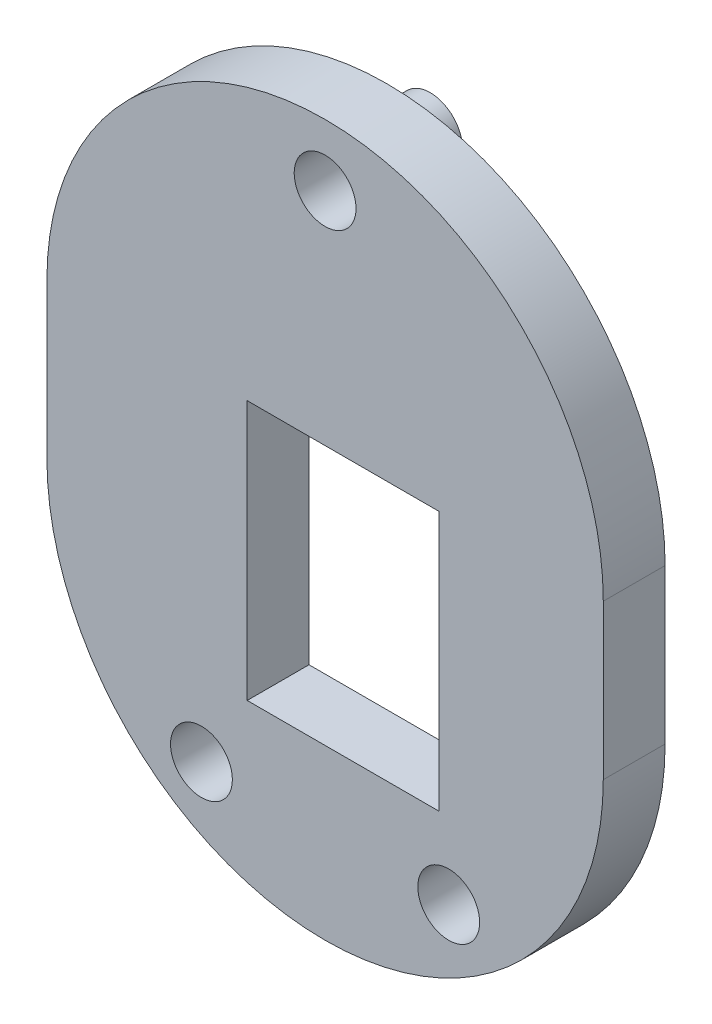
ISO-10303-21;
HEADER;
FILE_DESCRIPTION(('STEP AP214'),'2;1');
FILE_NAME('part.step','',(''),(''),'','','');
FILE_SCHEMA(('AUTOMOTIVE_DESIGN { 1 0 10303 214 1 1 1 1 }'));
ENDSEC;
DATA;
#1=APPLICATION_CONTEXT('core data for automotive mechanical design processes');
#2=APPLICATION_PROTOCOL_DEFINITION('international standard','automotive_design',2000,#1);
#3=PRODUCT_CONTEXT('',#1,'mechanical');
#4=PRODUCT('Part','Part','',(#3));
#5=PRODUCT_RELATED_PRODUCT_CATEGORY('part','',(#4));
#6=PRODUCT_DEFINITION_FORMATION('','',#4);
#7=PRODUCT_DEFINITION_CONTEXT('part definition',#1,'design');
#8=PRODUCT_DEFINITION('design','',#6,#7);
#9=PRODUCT_DEFINITION_SHAPE('','',#8);
#10=(LENGTH_UNIT() NAMED_UNIT(*) SI_UNIT(.MILLI.,.METRE.));
#11=(NAMED_UNIT(*) PLANE_ANGLE_UNIT() SI_UNIT($,.RADIAN.));
#12=(NAMED_UNIT(*) SI_UNIT($,.STERADIAN.) SOLID_ANGLE_UNIT());
#13=UNCERTAINTY_MEASURE_WITH_UNIT(LENGTH_MEASURE(1.E-05),#10,'distance_accuracy_value','');
#14=(GEOMETRIC_REPRESENTATION_CONTEXT(3) GLOBAL_UNCERTAINTY_ASSIGNED_CONTEXT((#13)) GLOBAL_UNIT_ASSIGNED_CONTEXT((#10,
#11,#12)) REPRESENTATION_CONTEXT('',''));
#15=CARTESIAN_POINT('',(0.,0.,0.));
#16=DIRECTION('',(0.,0.,1.));
#17=DIRECTION('',(1.,0.,0.));
#18=AXIS2_PLACEMENT_3D('',#15,#16,#17);
#19=CARTESIAN_POINT('',(0.,12.5,-1.7));
#20=DIRECTION('',(0.,0.,-1.));
#21=DIRECTION('',(1.,0.,0.));
#22=AXIS2_PLACEMENT_3D('',#19,#20,#21);
#23=PLANE('',#22);
#24=DIRECTION('',(0.,1.,0.));
#25=VECTOR('',#24,1.);
#26=CARTESIAN_POINT('',(-37.,-6.48399884812534,-1.7));
#27=LINE('',#26,#25);
#28=CARTESIAN_POINT('',(-37.,-2.55,-1.7));
#29=VERTEX_POINT('',#28);
#30=CARTESIAN_POINT('',(-37.,0.7,-1.7));
#31=VERTEX_POINT('',#30);
#32=EDGE_CURVE('E237',#29,#31,#27,.T.);
#33=ORIENTED_EDGE('',*,*,#32,.F.);
#34=DIRECTION('',(-1.,0.,0.));
#35=VECTOR('',#34,1.);
#36=CARTESIAN_POINT('',(-14.5,-2.55,-1.7));
#37=LINE('',#36,#35);
#38=CARTESIAN_POINT('',(-39.5,-2.55,-1.7));
#39=VERTEX_POINT('',#38);
#40=EDGE_CURVE('E224',#29,#39,#37,.T.);
#41=ORIENTED_EDGE('',*,*,#40,.T.);
#42=DIRECTION('',(0.,1.,0.));
#43=VECTOR('',#42,1.);
#44=CARTESIAN_POINT('',(-39.5,-4.87523873730206,-1.7));
#45=LINE('',#44,#43);
#46=CARTESIAN_POINT('',(-39.5,0.7,-1.7));
#47=VERTEX_POINT('',#46);
#48=EDGE_CURVE('E235',#39,#47,#45,.T.);
#49=ORIENTED_EDGE('',*,*,#48,.T.);
#50=DIRECTION('',(1.,0.,0.));
#51=VECTOR('',#50,1.);
#52=CARTESIAN_POINT('',(-36.6510171443224,0.7,-1.7));
#53=LINE('',#52,#51);
#54=EDGE_CURVE('E254',#47,#31,#53,.T.);
#55=ORIENTED_EDGE('',*,*,#54,.T.);
#56=EDGE_LOOP('',(#33,#41,#49,#55));
#57=FACE_BOUND('',#56,.T.);
#58=ADVANCED_FACE('F16',(#57),#23,.T.);
#59=CARTESIAN_POINT('',(-39.5,-4.87523873730206,-1.7));
#60=DIRECTION('',(1.,0.,0.));
#61=DIRECTION('',(0.,1.,0.));
#62=AXIS2_PLACEMENT_3D('',#59,#60,#61);
#63=PLANE('',#62);
#64=DIRECTION('',(0.,0.,1.));
#65=VECTOR('',#64,1.);
#66=CARTESIAN_POINT('',(-39.5,-10.55,-0.85));
#67=LINE('',#66,#65);
#68=CARTESIAN_POINT('',(-39.5,-10.55,-1.7));
#69=VERTEX_POINT('',#68);
#70=CARTESIAN_POINT('',(-39.5,-10.55,-1.));
#71=VERTEX_POINT('',#70);
#72=EDGE_CURVE('E230',#69,#71,#67,.T.);
#73=ORIENTED_EDGE('',*,*,#72,.F.);
#74=CARTESIAN_POINT('',(-39.5,-13.8,-1.7));
#75=VERTEX_POINT('',#74);
#76=EDGE_CURVE('E247',#75,#69,#45,.T.);
#77=ORIENTED_EDGE('',*,*,#76,.F.);
#78=DIRECTION('',(0.,0.,1.));
#79=VECTOR('',#78,1.);
#80=CARTESIAN_POINT('',(-39.5,-13.8,-1.7));
#81=LINE('',#80,#79);
#82=CARTESIAN_POINT('',(-39.5,-13.8,0.));
#83=VERTEX_POINT('',#82);
#84=EDGE_CURVE('E269',#75,#83,#81,.T.);
#85=ORIENTED_EDGE('',*,*,#84,.T.);
#86=DIRECTION('',(0.,1.,0.));
#87=VECTOR('',#86,1.);
#88=CARTESIAN_POINT('',(-39.5,-4.87523873730206,0.));
#89=LINE('',#88,#87);
#90=CARTESIAN_POINT('',(-39.5,-13.,0.));
#91=VERTEX_POINT('',#90);
#92=EDGE_CURVE('E270',#83,#91,#89,.T.);
#93=ORIENTED_EDGE('',*,*,#92,.T.);
#94=DIRECTION('',(0.,0.,-1.));
#95=VECTOR('',#94,1.);
#96=CARTESIAN_POINT('',(-39.5,-13.,-0.5));
#97=LINE('',#96,#95);
#98=CARTESIAN_POINT('',(-39.5,-13.,-1.));
#99=VERTEX_POINT('',#98);
#100=EDGE_CURVE('E543',#91,#99,#97,.T.);
#101=ORIENTED_EDGE('',*,*,#100,.T.);
#102=DIRECTION('',(0.,1.,0.));
#103=VECTOR('',#102,1.);
#104=CARTESIAN_POINT('',(-39.5,-7.32912922858444,-1.));
#105=LINE('',#104,#103);
#106=EDGE_CURVE('E547',#99,#71,#105,.T.);
#107=ORIENTED_EDGE('',*,*,#106,.T.);
#108=EDGE_LOOP('',(#73,#77,#85,#93,#101,#107));
#109=FACE_BOUND('',#108,.T.);
#110=ADVANCED_FACE('F613',(#109),#63,.F.);
#111=CARTESIAN_POINT('',(-37.,-6.48399884812534,-1.7));
#112=DIRECTION('',(1.,0.,0.));
#113=DIRECTION('',(0.,1.,0.));
#114=AXIS2_PLACEMENT_3D('',#111,#112,#113);
#115=PLANE('',#114);
#116=DIRECTION('',(0.,-1.,0.));
#117=VECTOR('',#116,1.);
#118=CARTESIAN_POINT('',(-37.,-6.48399884812534,-1.));
#119=LINE('',#118,#117);
#120=CARTESIAN_POINT('',(-37.,0.,-1.));
#121=VERTEX_POINT('',#120);
#122=CARTESIAN_POINT('',(-37.,-2.55,-1.));
#123=VERTEX_POINT('',#122);
#124=EDGE_CURVE('E373',#121,#123,#119,.T.);
#125=ORIENTED_EDGE('',*,*,#124,.T.);
#126=DIRECTION('',(0.,0.,-1.));
#127=VECTOR('',#126,1.);
#128=CARTESIAN_POINT('',(-37.,-2.55,-1.7));
#129=LINE('',#128,#127);
#130=EDGE_CURVE('E495',#123,#29,#129,.T.);
#131=ORIENTED_EDGE('',*,*,#130,.T.);
#132=ORIENTED_EDGE('',*,*,#32,.T.);
#133=DIRECTION('',(0.,0.,1.));
#134=VECTOR('',#133,1.);
#135=CARTESIAN_POINT('',(-37.,0.7,-1.7));
#136=LINE('',#135,#134);
#137=CARTESIAN_POINT('',(-37.,0.7,0.));
#138=VERTEX_POINT('',#137);
#139=EDGE_CURVE('E286',#31,#138,#136,.T.);
#140=ORIENTED_EDGE('',*,*,#139,.T.);
#141=DIRECTION('',(0.,1.,0.));
#142=VECTOR('',#141,1.);
#143=CARTESIAN_POINT('',(-37.,-6.48399884812534,0.));
#144=LINE('',#143,#142);
#145=CARTESIAN_POINT('',(-37.,0.,0.));
#146=VERTEX_POINT('',#145);
#147=EDGE_CURVE('E278',#146,#138,#144,.T.);
#148=ORIENTED_EDGE('',*,*,#147,.F.);
#149=DIRECTION('',(0.,0.,1.));
#150=VECTOR('',#149,1.);
#151=CARTESIAN_POINT('',(-37.,0.,-1.7));
#152=LINE('',#151,#150);
#153=EDGE_CURVE('E492',#121,#146,#152,.T.);
#154=ORIENTED_EDGE('',*,*,#153,.F.);
#155=EDGE_LOOP('',(#125,#131,#132,#140,#148,#154));
#156=FACE_BOUND('',#155,.T.);
#157=ADVANCED_FACE('F563',(#156),#115,.T.);
#158=CARTESIAN_POINT('',(0.,12.5,0.));
#159=DIRECTION('',(0.,0.,1.));
#160=DIRECTION('',(1.,0.,0.));
#161=AXIS2_PLACEMENT_3D('',#158,#159,#160);
#162=PLANE('',#161);
#163=CARTESIAN_POINT('',(-39.5,0.,0.));
#164=VERTEX_POINT('',#163);
#165=CARTESIAN_POINT('',(-39.5,0.7,0.));
#166=VERTEX_POINT('',#165);
#167=EDGE_CURVE('E239',#164,#166,#89,.T.);
#168=ORIENTED_EDGE('',*,*,#167,.F.);
#169=DIRECTION('',(-1.,0.,0.));
#170=VECTOR('',#169,1.);
#171=CARTESIAN_POINT('',(-14.5,0.,0.));
#172=LINE('',#171,#170);
#173=EDGE_CURVE('E529',#146,#164,#172,.T.);
#174=ORIENTED_EDGE('',*,*,#173,.F.);
#175=ORIENTED_EDGE('',*,*,#147,.T.);
#176=DIRECTION('',(1.,0.,0.));
#177=VECTOR('',#176,1.);
#178=CARTESIAN_POINT('',(-36.6510171443224,0.7,0.));
#179=LINE('',#178,#177);
#180=EDGE_CURVE('E274',#166,#138,#179,.T.);
#181=ORIENTED_EDGE('',*,*,#180,.F.);
#182=EDGE_LOOP('',(#168,#174,#175,#181));
#183=FACE_BOUND('',#182,.T.);
#184=CARTESIAN_POINT('',(-37.,-13.8,0.));
#185=VERTEX_POINT('',#184);
#186=CARTESIAN_POINT('',(-37.,-13.,0.));
#187=VERTEX_POINT('',#186);
#188=EDGE_CURVE('E49',#185,#187,#144,.T.);
#189=ORIENTED_EDGE('',*,*,#188,.T.);
#190=DIRECTION('',(-1.,0.,0.));
#191=VECTOR('',#190,1.);
#192=CARTESIAN_POINT('',(-14.5,-13.,0.));
#193=LINE('',#192,#191);
#194=EDGE_CURVE('E524',#187,#91,#193,.T.);
#195=ORIENTED_EDGE('',*,*,#194,.T.);
#196=ORIENTED_EDGE('',*,*,#92,.F.);
#197=DIRECTION('',(1.,0.,0.));
#198=VECTOR('',#197,1.);
#199=CARTESIAN_POINT('',(-36.6510171443224,-13.8,0.));
#200=LINE('',#199,#198);
#201=EDGE_CURVE('E248',#83,#185,#200,.T.);
#202=ORIENTED_EDGE('',*,*,#201,.T.);
#203=EDGE_LOOP('',(#189,#195,#196,#202));
#204=FACE_BOUND('',#203,.T.);
#205=DIRECTION('',(1.,0.,0.));
#206=VECTOR('',#205,1.);
#207=CARTESIAN_POINT('',(2.93168006464839,26.8,0.));
#208=LINE('',#207,#206);
#209=CARTESIAN_POINT('',(-12.6,26.8,0.));
#210=VERTEX_POINT('',#209);
#211=CARTESIAN_POINT('',(18.4,26.8,0.));
#212=VERTEX_POINT('',#211);
#213=EDGE_CURVE('E292',#210,#212,#208,.T.);
#214=ORIENTED_EDGE('',*,*,#213,.F.);
#215=DIRECTION('',(0.,-1.,0.));
#216=VECTOR('',#215,1.);
#217=CARTESIAN_POINT('',(-12.6,-19.7,0.));
#218=LINE('',#217,#216);
#219=CARTESIAN_POINT('',(-12.6,24.3,0.));
#220=VERTEX_POINT('',#219);
#221=EDGE_CURVE('E298',#210,#220,#218,.T.);
#222=ORIENTED_EDGE('',*,*,#221,.T.);
#223=DIRECTION('',(0.,-1.,0.));
#224=VECTOR('',#223,1.);
#225=CARTESIAN_POINT('',(-12.6,12.5,0.));
#226=LINE('',#225,#224);
#227=CARTESIAN_POINT('',(-12.6,-17.7,0.));
#228=VERTEX_POINT('',#227);
#229=EDGE_CURVE('E390',#220,#228,#226,.T.);
#230=ORIENTED_EDGE('',*,*,#229,.T.);
#231=DIRECTION('',(1.,0.,0.));
#232=VECTOR('',#231,1.);
#233=CARTESIAN_POINT('',(0.,-17.7,0.));
#234=LINE('',#233,#232);
#235=CARTESIAN_POINT('',(18.4,-17.7,0.));
#236=VERTEX_POINT('',#235);
#237=EDGE_CURVE('E464',#228,#236,#234,.T.);
#238=ORIENTED_EDGE('',*,*,#237,.T.);
#239=DIRECTION('',(0.,-1.,0.));
#240=VECTOR('',#239,1.);
#241=CARTESIAN_POINT('',(18.4,12.5,0.));
#242=LINE('',#241,#240);
#243=CARTESIAN_POINT('',(18.4,24.3,0.));
#244=VERTEX_POINT('',#243);
#245=EDGE_CURVE('E461',#244,#236,#242,.T.);
#246=ORIENTED_EDGE('',*,*,#245,.F.);
#247=DIRECTION('',(0.,-1.,0.));
#248=VECTOR('',#247,1.);
#249=CARTESIAN_POINT('',(18.4,-19.6493687108159,0.));
#250=LINE('',#249,#248);
#251=EDGE_CURVE('E313',#212,#244,#250,.T.);
#252=ORIENTED_EDGE('',*,*,#251,.F.);
#253=EDGE_LOOP('',(#214,#222,#230,#238,#246,#252));
#254=FACE_BOUND('',#253,.T.);
#255=CARTESIAN_POINT('',(-20.,-30.,0.));
#256=DIRECTION('',(0.,0.,-1.));
#257=DIRECTION('',(1.,0.,0.));
#258=AXIS2_PLACEMENT_3D('',#255,#256,#257);
#259=CIRCLE('',#258,5.25);
#260=CARTESIAN_POINT('',(-14.75,-30.,0.));
#261=VERTEX_POINT('',#260);
#262=EDGE_CURVE('E369',#261,#261,#259,.T.);
#263=ORIENTED_EDGE('',*,*,#262,.F.);
#264=EDGE_LOOP('',(#263));
#265=FACE_BOUND('',#264,.T.);
#266=CARTESIAN_POINT('',(20.,-30.,0.));
#267=DIRECTION('',(0.,0.,-1.));
#268=DIRECTION('',(1.,0.,0.));
#269=AXIS2_PLACEMENT_3D('',#266,#267,#268);
#270=CIRCLE('',#269,5.25);
#271=CARTESIAN_POINT('',(25.25,-30.,0.));
#272=VERTEX_POINT('',#271);
#273=EDGE_CURVE('E374',#272,#272,#270,.T.);
#274=ORIENTED_EDGE('',*,*,#273,.F.);
#275=EDGE_LOOP('',(#274));
#276=FACE_BOUND('',#275,.T.);
#277=CARTESIAN_POINT('',(0.,60.,0.));
#278=DIRECTION('',(0.,0.,-1.));
#279=DIRECTION('',(1.,0.,0.));
#280=AXIS2_PLACEMENT_3D('',#277,#278,#279);
#281=CIRCLE('',#280,5.25);
#282=CARTESIAN_POINT('',(5.25,60.,0.));
#283=VERTEX_POINT('',#282);
#284=EDGE_CURVE('E382',#283,#283,#281,.T.);
#285=ORIENTED_EDGE('',*,*,#284,.F.);
#286=EDGE_LOOP('',(#285));
#287=FACE_BOUND('',#286,.T.);
#288=CARTESIAN_POINT('',(0.,25.,0.));
#289=DIRECTION('',(0.,0.,1.));
#290=DIRECTION('',(1.,0.,0.));
#291=AXIS2_PLACEMENT_3D('',#288,#289,#290);
#292=CIRCLE('',#291,45.);
#293=CARTESIAN_POINT('',(-45.,25.,0.));
#294=VERTEX_POINT('',#293);
#295=CARTESIAN_POINT('',(45.,25.,0.));
#296=VERTEX_POINT('',#295);
#297=EDGE_CURVE('E448',#294,#296,#292,.F.);
#298=ORIENTED_EDGE('',*,*,#297,.T.);
#299=DIRECTION('',(0.,-1.,0.));
#300=VECTOR('',#299,1.);
#301=CARTESIAN_POINT('',(45.,35.2162681519985,0.));
#302=LINE('',#301,#300);
#303=CARTESIAN_POINT('',(45.,0.,0.));
#304=VERTEX_POINT('',#303);
#305=EDGE_CURVE('E419',#296,#304,#302,.T.);
#306=ORIENTED_EDGE('',*,*,#305,.T.);
#307=CARTESIAN_POINT('',(0.,0.,0.));
#308=DIRECTION('',(0.,0.,1.));
#309=DIRECTION('',(-1.,0.,0.));
#310=AXIS2_PLACEMENT_3D('',#307,#308,#309);
#311=CIRCLE('',#310,45.);
#312=CARTESIAN_POINT('',(-45.,0.,0.));
#313=VERTEX_POINT('',#312);
#314=EDGE_CURVE('E424',#313,#304,#311,.T.);
#315=ORIENTED_EDGE('',*,*,#314,.F.);
#316=DIRECTION('',(0.,1.,0.));
#317=VECTOR('',#316,1.);
#318=CARTESIAN_POINT('',(-45.,35.2162681519985,0.));
#319=LINE('',#318,#317);
#320=EDGE_CURVE('E435',#313,#294,#319,.T.);
#321=ORIENTED_EDGE('',*,*,#320,.T.);
#322=EDGE_LOOP('',(#298,#306,#315,#321));
#323=FACE_BOUND('',#322,.T.);
#324=ADVANCED_FACE('F558',(#183,#204,#254,#265,#276,#287,#323),#162,.F.);
#325=CARTESIAN_POINT('',(45.,35.2162681519985,10.));
#326=DIRECTION('',(1.,0.,0.));
#327=DIRECTION('',(0.,1.,0.));
#328=AXIS2_PLACEMENT_3D('',#325,#326,#327);
#329=PLANE('',#328);
#330=ORIENTED_EDGE('',*,*,#305,.F.);
#331=DIRECTION('',(0.,0.,-1.));
#332=VECTOR('',#331,1.);
#333=CARTESIAN_POINT('',(45.,25.,10.));
#334=LINE('',#333,#332);
#335=CARTESIAN_POINT('',(45.,25.,10.));
#336=VERTEX_POINT('',#335);
#337=EDGE_CURVE('E451',#296,#336,#334,.F.);
#338=ORIENTED_EDGE('',*,*,#337,.T.);
#339=DIRECTION('',(0.,-1.,0.));
#340=VECTOR('',#339,1.);
#341=CARTESIAN_POINT('',(45.,35.2162681519985,10.));
#342=LINE('',#341,#340);
#343=CARTESIAN_POINT('',(45.,0.,10.));
#344=VERTEX_POINT('',#343);
#345=EDGE_CURVE('E420',#336,#344,#342,.T.);
#346=ORIENTED_EDGE('',*,*,#345,.T.);
#347=DIRECTION('',(0.,0.,-1.));
#348=VECTOR('',#347,1.);
#349=CARTESIAN_POINT('',(45.,0.,10.));
#350=LINE('',#349,#348);
#351=EDGE_CURVE('E432',#344,#304,#350,.T.);
#352=ORIENTED_EDGE('',*,*,#351,.T.);
#353=EDGE_LOOP('',(#330,#338,#346,#352));
#354=FACE_BOUND('',#353,.T.);
#355=ADVANCED_FACE('F562',(#354),#329,.T.);
#356=CARTESIAN_POINT('',(-45.,35.2162681519985,10.));
#357=DIRECTION('',(-1.,0.,0.));
#358=DIRECTION('',(0.,0.,1.));
#359=AXIS2_PLACEMENT_3D('',#356,#357,#358);
#360=PLANE('',#359);
#361=DIRECTION('',(0.,1.,0.));
#362=VECTOR('',#361,1.);
#363=CARTESIAN_POINT('',(-45.,35.2162681519985,10.));
#364=LINE('',#363,#362);
#365=CARTESIAN_POINT('',(-45.,0.,10.));
#366=VERTEX_POINT('',#365);
#367=CARTESIAN_POINT('',(-45.,25.,10.));
#368=VERTEX_POINT('',#367);
#369=EDGE_CURVE('E423',#366,#368,#364,.T.);
#370=ORIENTED_EDGE('',*,*,#369,.T.);
#371=DIRECTION('',(0.,0.,-1.));
#372=VECTOR('',#371,1.);
#373=CARTESIAN_POINT('',(-45.,25.,10.));
#374=LINE('',#373,#372);
#375=EDGE_CURVE('E458',#368,#294,#374,.T.);
#376=ORIENTED_EDGE('',*,*,#375,.T.);
#377=ORIENTED_EDGE('',*,*,#320,.F.);
#378=DIRECTION('',(0.,0.,-1.));
#379=VECTOR('',#378,1.);
#380=CARTESIAN_POINT('',(-45.,0.,10.));
#381=LINE('',#380,#379);
#382=EDGE_CURVE('E445',#366,#313,#381,.T.);
#383=ORIENTED_EDGE('',*,*,#382,.F.);
#384=EDGE_LOOP('',(#370,#376,#377,#383));
#385=FACE_BOUND('',#384,.T.);
#386=ADVANCED_FACE('F656',(#385),#360,.T.);
#387=CARTESIAN_POINT('',(0.,0.,10.));
#388=DIRECTION('',(0.,0.,-1.));
#389=DIRECTION('',(-1.,0.,0.));
#390=AXIS2_PLACEMENT_3D('',#387,#388,#389);
#391=CYLINDRICAL_SURFACE('',#390,45.);
#392=ORIENTED_EDGE('',*,*,#314,.T.);
#393=ORIENTED_EDGE('',*,*,#351,.F.);
#394=CARTESIAN_POINT('',(0.,0.,10.));
#395=DIRECTION('',(0.,0.,1.));
#396=DIRECTION('',(-1.,0.,0.));
#397=AXIS2_PLACEMENT_3D('',#394,#395,#396);
#398=CIRCLE('',#397,45.);
#399=EDGE_CURVE('E428',#366,#344,#398,.T.);
#400=ORIENTED_EDGE('',*,*,#399,.F.);
#401=ORIENTED_EDGE('',*,*,#382,.T.);
#402=EDGE_LOOP('',(#392,#393,#400,#401));
#403=FACE_BOUND('',#402,.T.);
#404=ADVANCED_FACE('F659',(#403),#391,.T.);
#405=CARTESIAN_POINT('',(0.,12.5,10.));
#406=DIRECTION('',(0.,0.,1.));
#407=DIRECTION('',(1.,0.,0.));
#408=AXIS2_PLACEMENT_3D('',#405,#406,#407);
#409=PLANE('',#408);
#410=CARTESIAN_POINT('',(0.,60.,10.));
#411=DIRECTION('',(0.,0.,1.));
#412=DIRECTION('',(1.,0.,0.));
#413=AXIS2_PLACEMENT_3D('',#410,#411,#412);
#414=CIRCLE('',#413,5.);
#415=CARTESIAN_POINT('',(5.,60.,10.));
#416=VERTEX_POINT('',#415);
#417=EDGE_CURVE('E353',#416,#416,#414,.F.);
#418=ORIENTED_EDGE('',*,*,#417,.T.);
#419=EDGE_LOOP('',(#418));
#420=FACE_BOUND('',#419,.T.);
#421=CARTESIAN_POINT('',(20.,-30.,10.));
#422=DIRECTION('',(0.,0.,1.));
#423=DIRECTION('',(1.,0.,0.));
#424=AXIS2_PLACEMENT_3D('',#421,#422,#423);
#425=CIRCLE('',#424,5.);
#426=CARTESIAN_POINT('',(25.,-30.,10.));
#427=VERTEX_POINT('',#426);
#428=EDGE_CURVE('E358',#427,#427,#425,.F.);
#429=ORIENTED_EDGE('',*,*,#428,.T.);
#430=EDGE_LOOP('',(#429));
#431=FACE_BOUND('',#430,.T.);
#432=CARTESIAN_POINT('',(-20.,-30.,10.));
#433=DIRECTION('',(0.,0.,1.));
#434=DIRECTION('',(1.,0.,0.));
#435=AXIS2_PLACEMENT_3D('',#432,#433,#434);
#436=CIRCLE('',#435,5.);
#437=CARTESIAN_POINT('',(-15.,-30.,10.));
#438=VERTEX_POINT('',#437);
#439=EDGE_CURVE('E363',#438,#438,#436,.F.);
#440=ORIENTED_EDGE('',*,*,#439,.T.);
#441=EDGE_LOOP('',(#440));
#442=FACE_BOUND('',#441,.T.);
#443=DIRECTION('',(0.,-1.,0.));
#444=VECTOR('',#443,1.);
#445=CARTESIAN_POINT('',(-12.6,2.71059665828943,10.));
#446=LINE('',#445,#444);
#447=CARTESIAN_POINT('',(-12.6,24.3,10.));
#448=VERTEX_POINT('',#447);
#449=CARTESIAN_POINT('',(-12.6,-17.7,10.));
#450=VERTEX_POINT('',#449);
#451=EDGE_CURVE('E386',#448,#450,#446,.T.);
#452=ORIENTED_EDGE('',*,*,#451,.F.);
#453=DIRECTION('',(1.,0.,0.));
#454=VECTOR('',#453,1.);
#455=CARTESIAN_POINT('',(4.27989056333899,24.3,10.));
#456=LINE('',#455,#454);
#457=CARTESIAN_POINT('',(18.4,24.3,10.));
#458=VERTEX_POINT('',#457);
#459=EDGE_CURVE('E402',#448,#458,#456,.T.);
#460=ORIENTED_EDGE('',*,*,#459,.T.);
#461=DIRECTION('',(0.,-1.,0.));
#462=VECTOR('',#461,1.);
#463=CARTESIAN_POINT('',(18.4,2.71059665828944,10.));
#464=LINE('',#463,#462);
#465=CARTESIAN_POINT('',(18.4,-17.7,10.));
#466=VERTEX_POINT('',#465);
#467=EDGE_CURVE('E398',#458,#466,#464,.T.);
#468=ORIENTED_EDGE('',*,*,#467,.T.);
#469=DIRECTION('',(1.,0.,0.));
#470=VECTOR('',#469,1.);
#471=CARTESIAN_POINT('',(2.9,-17.7,10.));
#472=LINE('',#471,#470);
#473=EDGE_CURVE('E394',#450,#466,#472,.T.);
#474=ORIENTED_EDGE('',*,*,#473,.F.);
#475=EDGE_LOOP('',(#452,#460,#468,#474));
#476=FACE_BOUND('',#475,.T.);
#477=ORIENTED_EDGE('',*,*,#345,.F.);
#478=CARTESIAN_POINT('',(0.,25.,10.));
#479=DIRECTION('',(0.,0.,1.));
#480=DIRECTION('',(1.,0.,0.));
#481=AXIS2_PLACEMENT_3D('',#478,#479,#480);
#482=CIRCLE('',#481,45.);
#483=EDGE_CURVE('E455',#336,#368,#482,.T.);
#484=ORIENTED_EDGE('',*,*,#483,.T.);
#485=ORIENTED_EDGE('',*,*,#369,.F.);
#486=ORIENTED_EDGE('',*,*,#399,.T.);
#487=EDGE_LOOP('',(#477,#484,#485,#486));
#488=FACE_BOUND('',#487,.T.);
#489=ADVANCED_FACE('F654',(#420,#431,#442,#476,#488),#409,.T.);
#490=CARTESIAN_POINT('',(0.,25.,10.));
#491=DIRECTION('',(0.,0.,-1.));
#492=DIRECTION('',(-1.,0.,0.));
#493=AXIS2_PLACEMENT_3D('',#490,#491,#492);
#494=CYLINDRICAL_SURFACE('',#493,45.);
#495=ORIENTED_EDGE('',*,*,#375,.F.);
#496=ORIENTED_EDGE('',*,*,#483,.F.);
#497=ORIENTED_EDGE('',*,*,#337,.F.);
#498=ORIENTED_EDGE('',*,*,#297,.F.);
#499=EDGE_LOOP('',(#495,#496,#497,#498));
#500=FACE_BOUND('',#499,.T.);
#501=ADVANCED_FACE('F18',(#500),#494,.T.);
#502=CARTESIAN_POINT('',(-12.6,2.71059665828943,-1.));
#503=DIRECTION('',(-1.,0.,0.));
#504=DIRECTION('',(0.,-1.,0.));
#505=AXIS2_PLACEMENT_3D('',#502,#503,#504);
#506=PLANE('',#505);
#507=DIRECTION('',(0.,0.,1.));
#508=VECTOR('',#507,1.);
#509=CARTESIAN_POINT('',(-12.6,24.3,-1.));
#510=LINE('',#509,#508);
#511=EDGE_CURVE('E406',#220,#448,#510,.T.);
#512=ORIENTED_EDGE('',*,*,#511,.T.);
#513=ORIENTED_EDGE('',*,*,#451,.T.);
#514=DIRECTION('',(0.,0.,1.));
#515=VECTOR('',#514,1.);
#516=CARTESIAN_POINT('',(-12.6,-17.7,-1.));
#517=LINE('',#516,#515);
#518=EDGE_CURVE('E416',#228,#450,#517,.T.);
#519=ORIENTED_EDGE('',*,*,#518,.F.);
#520=ORIENTED_EDGE('',*,*,#229,.F.);
#521=EDGE_LOOP('',(#512,#513,#519,#520));
#522=FACE_BOUND('',#521,.T.);
#523=ADVANCED_FACE('F678',(#522),#506,.F.);
#524=CARTESIAN_POINT('',(2.9,-17.7,-1.));
#525=DIRECTION('',(0.,-1.,0.));
#526=DIRECTION('',(0.,0.,-1.));
#527=AXIS2_PLACEMENT_3D('',#524,#525,#526);
#528=PLANE('',#527);
#529=ORIENTED_EDGE('',*,*,#518,.T.);
#530=ORIENTED_EDGE('',*,*,#473,.T.);
#531=DIRECTION('',(0.,0.,1.));
#532=VECTOR('',#531,1.);
#533=CARTESIAN_POINT('',(18.4,-17.7,-1.));
#534=LINE('',#533,#532);
#535=EDGE_CURVE('E413',#236,#466,#534,.T.);
#536=ORIENTED_EDGE('',*,*,#535,.F.);
#537=ORIENTED_EDGE('',*,*,#237,.F.);
#538=EDGE_LOOP('',(#529,#530,#536,#537));
#539=FACE_BOUND('',#538,.T.);
#540=ADVANCED_FACE('F707',(#539),#528,.F.);
#541=CARTESIAN_POINT('',(18.4,2.71059665828944,-1.));
#542=DIRECTION('',(-1.,0.,0.));
#543=DIRECTION('',(0.,-1.,0.));
#544=AXIS2_PLACEMENT_3D('',#541,#542,#543);
#545=PLANE('',#544);
#546=ORIENTED_EDGE('',*,*,#245,.T.);
#547=ORIENTED_EDGE('',*,*,#535,.T.);
#548=ORIENTED_EDGE('',*,*,#467,.F.);
#549=DIRECTION('',(0.,0.,1.));
#550=VECTOR('',#549,1.);
#551=CARTESIAN_POINT('',(18.4,24.3,-1.));
#552=LINE('',#551,#550);
#553=EDGE_CURVE('E409',#244,#458,#552,.T.);
#554=ORIENTED_EDGE('',*,*,#553,.F.);
#555=EDGE_LOOP('',(#546,#547,#548,#554));
#556=FACE_BOUND('',#555,.T.);
#557=ADVANCED_FACE('F715',(#556),#545,.T.);
#558=CARTESIAN_POINT('',(4.27989056333899,24.3,-1.));
#559=DIRECTION('',(0.,-1.,0.));
#560=DIRECTION('',(0.,0.,-1.));
#561=AXIS2_PLACEMENT_3D('',#558,#559,#560);
#562=PLANE('',#561);
#563=ORIENTED_EDGE('',*,*,#511,.F.);
#564=DIRECTION('',(0.,0.,1.));
#565=VECTOR('',#564,1.);
#566=CARTESIAN_POINT('',(-12.6,24.3,-1.7));
#567=LINE('',#566,#565);
#568=CARTESIAN_POINT('',(-12.6,24.3,-1.7));
#569=VERTEX_POINT('',#568);
#570=EDGE_CURVE('E322',#569,#220,#567,.T.);
#571=ORIENTED_EDGE('',*,*,#570,.F.);
#572=DIRECTION('',(1.,0.,0.));
#573=VECTOR('',#572,1.);
#574=CARTESIAN_POINT('',(0.,24.3,-1.7));
#575=LINE('',#574,#573);
#576=CARTESIAN_POINT('',(18.4,24.3,-1.7));
#577=VERTEX_POINT('',#576);
#578=EDGE_CURVE('E301',#569,#577,#575,.T.);
#579=ORIENTED_EDGE('',*,*,#578,.T.);
#580=DIRECTION('',(0.,0.,1.));
#581=VECTOR('',#580,1.);
#582=CARTESIAN_POINT('',(18.4,24.3,-1.7));
#583=LINE('',#582,#581);
#584=EDGE_CURVE('E326',#577,#244,#583,.T.);
#585=ORIENTED_EDGE('',*,*,#584,.T.);
#586=ORIENTED_EDGE('',*,*,#553,.T.);
#587=ORIENTED_EDGE('',*,*,#459,.F.);
#588=EDGE_LOOP('',(#563,#571,#579,#585,#586,#587));
#589=FACE_BOUND('',#588,.T.);
#590=ADVANCED_FACE('F721',(#589),#562,.T.);
#591=CARTESIAN_POINT('',(0.,60.,-7.));
#592=DIRECTION('',(0.,0.,1.));
#593=DIRECTION('',(1.,0.,0.));
#594=AXIS2_PLACEMENT_3D('',#591,#592,#593);
#595=CYLINDRICAL_SURFACE('',#594,5.25);
#596=CARTESIAN_POINT('',(0.,60.,-7.));
#597=DIRECTION('',(0.,0.,-1.));
#598=DIRECTION('',(1.,0.,0.));
#599=AXIS2_PLACEMENT_3D('',#596,#597,#598);
#600=CIRCLE('',#599,5.25);
#601=CARTESIAN_POINT('',(5.25,60.,-7.));
#602=VERTEX_POINT('',#601);
#603=EDGE_CURVE('E378',#602,#602,#600,.T.);
#604=ORIENTED_EDGE('',*,*,#603,.F.);
#605=EDGE_LOOP('',(#604));
#606=FACE_BOUND('',#605,.T.);
#607=ORIENTED_EDGE('',*,*,#284,.T.);
#608=EDGE_LOOP('',(#607));
#609=FACE_BOUND('',#608,.T.);
#610=ADVANCED_FACE('F728',(#606,#609),#595,.T.);
#611=CARTESIAN_POINT('',(0.,12.5,-7.));
#612=DIRECTION('',(0.,0.,-1.));
#613=DIRECTION('',(1.,0.,0.));
#614=AXIS2_PLACEMENT_3D('',#611,#612,#613);
#615=PLANE('',#614);
#616=CARTESIAN_POINT('',(0.,60.,-7.));
#617=DIRECTION('',(0.,0.,-1.));
#618=DIRECTION('',(-1.,0.,0.));
#619=AXIS2_PLACEMENT_3D('',#616,#617,#618);
#620=CIRCLE('',#619,3.25);
#621=CARTESIAN_POINT('',(-3.25,60.,-7.));
#622=VERTEX_POINT('',#621);
#623=EDGE_CURVE('E343',#622,#622,#620,.F.);
#624=ORIENTED_EDGE('',*,*,#623,.T.);
#625=EDGE_LOOP('',(#624));
#626=FACE_BOUND('',#625,.T.);
#627=ORIENTED_EDGE('',*,*,#603,.T.);
#628=EDGE_LOOP('',(#627));
#629=FACE_BOUND('',#628,.T.);
#630=ADVANCED_FACE('F735',(#626,#629),#615,.T.);
#631=CARTESIAN_POINT('',(20.,-30.,-7.));
#632=DIRECTION('',(0.,0.,1.));
#633=DIRECTION('',(1.,0.,0.));
#634=AXIS2_PLACEMENT_3D('',#631,#632,#633);
#635=CYLINDRICAL_SURFACE('',#634,5.25);
#636=CARTESIAN_POINT('',(20.,-30.,-7.));
#637=DIRECTION('',(0.,0.,-1.));
#638=DIRECTION('',(1.,0.,0.));
#639=AXIS2_PLACEMENT_3D('',#636,#637,#638);
#640=CIRCLE('',#639,5.25);
#641=CARTESIAN_POINT('',(25.25,-30.,-7.));
#642=VERTEX_POINT('',#641);
#643=EDGE_CURVE('E368',#642,#642,#640,.T.);
#644=ORIENTED_EDGE('',*,*,#643,.F.);
#645=EDGE_LOOP('',(#644));
#646=FACE_BOUND('',#645,.T.);
#647=ORIENTED_EDGE('',*,*,#273,.T.);
#648=EDGE_LOOP('',(#647));
#649=FACE_BOUND('',#648,.T.);
#650=ADVANCED_FACE('F742',(#646,#649),#635,.T.);
#651=CARTESIAN_POINT('',(0.,12.5,-7.));
#652=DIRECTION('',(0.,0.,-1.));
#653=DIRECTION('',(1.,0.,0.));
#654=AXIS2_PLACEMENT_3D('',#651,#652,#653);
#655=PLANE('',#654);
#656=CARTESIAN_POINT('',(20.,-30.,-7.));
#657=DIRECTION('',(0.,0.,-1.));
#658=DIRECTION('',(-1.,0.,0.));
#659=AXIS2_PLACEMENT_3D('',#656,#657,#658);
#660=CIRCLE('',#659,3.25);
#661=CARTESIAN_POINT('',(16.75,-30.,-7.));
#662=VERTEX_POINT('',#661);
#663=EDGE_CURVE('E348',#662,#662,#660,.F.);
#664=ORIENTED_EDGE('',*,*,#663,.T.);
#665=EDGE_LOOP('',(#664));
#666=FACE_BOUND('',#665,.T.);
#667=ORIENTED_EDGE('',*,*,#643,.T.);
#668=EDGE_LOOP('',(#667));
#669=FACE_BOUND('',#668,.T.);
#670=ADVANCED_FACE('F751',(#666,#669),#655,.T.);
#671=CARTESIAN_POINT('',(-20.,-30.,-7.));
#672=DIRECTION('',(0.,0.,1.));
#673=DIRECTION('',(1.,0.,0.));
#674=AXIS2_PLACEMENT_3D('',#671,#672,#673);
#675=CYLINDRICAL_SURFACE('',#674,5.25);
#676=CARTESIAN_POINT('',(-20.,-30.,-7.));
#677=DIRECTION('',(0.,0.,-1.));
#678=DIRECTION('',(1.,0.,0.));
#679=AXIS2_PLACEMENT_3D('',#676,#677,#678);
#680=CIRCLE('',#679,5.25);
#681=CARTESIAN_POINT('',(-14.75,-30.,-7.));
#682=VERTEX_POINT('',#681);
#683=EDGE_CURVE('E364',#682,#682,#680,.T.);
#684=ORIENTED_EDGE('',*,*,#683,.F.);
#685=EDGE_LOOP('',(#684));
#686=FACE_BOUND('',#685,.T.);
#687=ORIENTED_EDGE('',*,*,#262,.T.);
#688=EDGE_LOOP('',(#687));
#689=FACE_BOUND('',#688,.T.);
#690=ADVANCED_FACE('F758',(#686,#689),#675,.T.);
#691=CARTESIAN_POINT('',(0.,12.5,-7.));
#692=DIRECTION('',(0.,0.,-1.));
#693=DIRECTION('',(1.,0.,0.));
#694=AXIS2_PLACEMENT_3D('',#691,#692,#693);
#695=PLANE('',#694);
#696=CARTESIAN_POINT('',(-20.,-30.,-7.));
#697=DIRECTION('',(0.,0.,-1.));
#698=DIRECTION('',(-1.,0.,0.));
#699=AXIS2_PLACEMENT_3D('',#696,#697,#698);
#700=CIRCLE('',#699,3.25);
#701=CARTESIAN_POINT('',(-23.25,-30.,-7.));
#702=VERTEX_POINT('',#701);
#703=EDGE_CURVE('E338',#702,#702,#700,.F.);
#704=ORIENTED_EDGE('',*,*,#703,.T.);
#705=EDGE_LOOP('',(#704));
#706=FACE_BOUND('',#705,.T.);
#707=ORIENTED_EDGE('',*,*,#683,.T.);
#708=EDGE_LOOP('',(#707));
#709=FACE_BOUND('',#708,.T.);
#710=ADVANCED_FACE('F767',(#706,#709),#695,.T.);
#711=CARTESIAN_POINT('',(-20.,-30.,148.519157366624));
#712=DIRECTION('',(0.,0.,-1.));
#713=DIRECTION('',(-1.,0.,0.));
#714=AXIS2_PLACEMENT_3D('',#711,#712,#713);
#715=CYLINDRICAL_SURFACE('',#714,5.);
#716=ORIENTED_EDGE('',*,*,#439,.F.);
#717=EDGE_LOOP('',(#716));
#718=FACE_BOUND('',#717,.T.);
#719=CARTESIAN_POINT('',(-20.,-30.,0.));
#720=DIRECTION('',(0.,0.,-1.));
#721=DIRECTION('',(-1.,0.,0.));
#722=AXIS2_PLACEMENT_3D('',#719,#720,#721);
#723=CIRCLE('',#722,5.);
#724=CARTESIAN_POINT('',(-25.,-30.,0.));
#725=VERTEX_POINT('',#724);
#726=EDGE_CURVE('E359',#725,#725,#723,.T.);
#727=ORIENTED_EDGE('',*,*,#726,.T.);
#728=EDGE_LOOP('',(#727));
#729=FACE_BOUND('',#728,.T.);
#730=ADVANCED_FACE('F774',(#718,#729),#715,.F.);
#731=CARTESIAN_POINT('',(-20.,-27.5,0.));
#732=DIRECTION('',(0.,0.,1.));
#733=DIRECTION('',(1.,0.,0.));
#734=AXIS2_PLACEMENT_3D('',#731,#732,#733);
#735=PLANE('',#734);
#736=CARTESIAN_POINT('',(-20.,-30.,0.));
#737=DIRECTION('',(0.,0.,1.));
#738=DIRECTION('',(1.,0.,0.));
#739=AXIS2_PLACEMENT_3D('',#736,#737,#738);
#740=CIRCLE('',#739,3.25);
#741=CARTESIAN_POINT('',(-16.75,-30.,0.));
#742=VERTEX_POINT('',#741);
#743=EDGE_CURVE('E334',#742,#742,#740,.T.);
#744=ORIENTED_EDGE('',*,*,#743,.F.);
#745=EDGE_LOOP('',(#744));
#746=FACE_BOUND('',#745,.T.);
#747=ORIENTED_EDGE('',*,*,#726,.F.);
#748=EDGE_LOOP('',(#747));
#749=FACE_BOUND('',#748,.T.);
#750=ADVANCED_FACE('F783',(#746,#749),#735,.T.);
#751=CARTESIAN_POINT('',(20.,-30.,148.519157366624));
#752=DIRECTION('',(0.,0.,-1.));
#753=DIRECTION('',(-1.,0.,0.));
#754=AXIS2_PLACEMENT_3D('',#751,#752,#753);
#755=CYLINDRICAL_SURFACE('',#754,5.);
#756=ORIENTED_EDGE('',*,*,#428,.F.);
#757=EDGE_LOOP('',(#756));
#758=FACE_BOUND('',#757,.T.);
#759=CARTESIAN_POINT('',(20.,-30.,0.));
#760=DIRECTION('',(0.,0.,-1.));
#761=DIRECTION('',(-1.,0.,0.));
#762=AXIS2_PLACEMENT_3D('',#759,#760,#761);
#763=CIRCLE('',#762,5.);
#764=CARTESIAN_POINT('',(15.,-30.,0.));
#765=VERTEX_POINT('',#764);
#766=EDGE_CURVE('E354',#765,#765,#763,.T.);
#767=ORIENTED_EDGE('',*,*,#766,.T.);
#768=EDGE_LOOP('',(#767));
#769=FACE_BOUND('',#768,.T.);
#770=ADVANCED_FACE('F789',(#758,#769),#755,.F.);
#771=CARTESIAN_POINT('',(20.,-27.5,0.));
#772=DIRECTION('',(0.,0.,1.));
#773=DIRECTION('',(1.,0.,0.));
#774=AXIS2_PLACEMENT_3D('',#771,#772,#773);
#775=PLANE('',#774);
#776=CARTESIAN_POINT('',(20.,-30.,0.));
#777=DIRECTION('',(0.,0.,1.));
#778=DIRECTION('',(1.,0.,0.));
#779=AXIS2_PLACEMENT_3D('',#776,#777,#778);
#780=CIRCLE('',#779,3.25);
#781=CARTESIAN_POINT('',(23.25,-30.,0.));
#782=VERTEX_POINT('',#781);
#783=EDGE_CURVE('E344',#782,#782,#780,.T.);
#784=ORIENTED_EDGE('',*,*,#783,.F.);
#785=EDGE_LOOP('',(#784));
#786=FACE_BOUND('',#785,.T.);
#787=ORIENTED_EDGE('',*,*,#766,.F.);
#788=EDGE_LOOP('',(#787));
#789=FACE_BOUND('',#788,.T.);
#790=ADVANCED_FACE('F796',(#786,#789),#775,.T.);
#791=CARTESIAN_POINT('',(0.,60.,148.519157366624));
#792=DIRECTION('',(0.,0.,-1.));
#793=DIRECTION('',(-1.,0.,0.));
#794=AXIS2_PLACEMENT_3D('',#791,#792,#793);
#795=CYLINDRICAL_SURFACE('',#794,5.);
#796=ORIENTED_EDGE('',*,*,#417,.F.);
#797=EDGE_LOOP('',(#796));
#798=FACE_BOUND('',#797,.T.);
#799=CARTESIAN_POINT('',(0.,60.,0.));
#800=DIRECTION('',(0.,0.,-1.));
#801=DIRECTION('',(-1.,0.,0.));
#802=AXIS2_PLACEMENT_3D('',#799,#800,#801);
#803=CIRCLE('',#802,5.);
#804=CARTESIAN_POINT('',(-5.,60.,0.));
#805=VERTEX_POINT('',#804);
#806=EDGE_CURVE('E349',#805,#805,#803,.T.);
#807=ORIENTED_EDGE('',*,*,#806,.T.);
#808=EDGE_LOOP('',(#807));
#809=FACE_BOUND('',#808,.T.);
#810=ADVANCED_FACE('F802',(#798,#809),#795,.F.);
#811=CARTESIAN_POINT('',(0.,62.5,0.));
#812=DIRECTION('',(0.,0.,1.));
#813=DIRECTION('',(1.,0.,0.));
#814=AXIS2_PLACEMENT_3D('',#811,#812,#813);
#815=PLANE('',#814);
#816=CARTESIAN_POINT('',(0.,60.,0.));
#817=DIRECTION('',(0.,0.,1.));
#818=DIRECTION('',(1.,0.,0.));
#819=AXIS2_PLACEMENT_3D('',#816,#817,#818);
#820=CIRCLE('',#819,3.25);
#821=CARTESIAN_POINT('',(3.25,60.,0.));
#822=VERTEX_POINT('',#821);
#823=EDGE_CURVE('E339',#822,#822,#820,.T.);
#824=ORIENTED_EDGE('',*,*,#823,.F.);
#825=EDGE_LOOP('',(#824));
#826=FACE_BOUND('',#825,.T.);
#827=ORIENTED_EDGE('',*,*,#806,.F.);
#828=EDGE_LOOP('',(#827));
#829=FACE_BOUND('',#828,.T.);
#830=ADVANCED_FACE('F809',(#826,#829),#815,.T.);
#831=CARTESIAN_POINT('',(20.,-30.,-147.993404324975));
#832=DIRECTION('',(0.,0.,1.));
#833=DIRECTION('',(1.,0.,0.));
#834=AXIS2_PLACEMENT_3D('',#831,#832,#833);
#835=CYLINDRICAL_SURFACE('',#834,3.25);
#836=ORIENTED_EDGE('',*,*,#663,.F.);
#837=EDGE_LOOP('',(#836));
#838=FACE_BOUND('',#837,.T.);
#839=ORIENTED_EDGE('',*,*,#783,.T.);
#840=EDGE_LOOP('',(#839));
#841=FACE_BOUND('',#840,.T.);
#842=ADVANCED_FACE('F815',(#838,#841),#835,.F.);
#843=CARTESIAN_POINT('',(0.,60.,-147.993404324975));
#844=DIRECTION('',(0.,0.,1.));
#845=DIRECTION('',(1.,0.,0.));
#846=AXIS2_PLACEMENT_3D('',#843,#844,#845);
#847=CYLINDRICAL_SURFACE('',#846,3.25);
#848=ORIENTED_EDGE('',*,*,#623,.F.);
#849=EDGE_LOOP('',(#848));
#850=FACE_BOUND('',#849,.T.);
#851=ORIENTED_EDGE('',*,*,#823,.T.);
#852=EDGE_LOOP('',(#851));
#853=FACE_BOUND('',#852,.T.);
#854=ADVANCED_FACE('F821',(#850,#853),#847,.F.);
#855=CARTESIAN_POINT('',(-20.,-30.,-147.993404324975));
#856=DIRECTION('',(0.,0.,1.));
#857=DIRECTION('',(1.,0.,0.));
#858=AXIS2_PLACEMENT_3D('',#855,#856,#857);
#859=CYLINDRICAL_SURFACE('',#858,3.25);
#860=ORIENTED_EDGE('',*,*,#703,.F.);
#861=EDGE_LOOP('',(#860));
#862=FACE_BOUND('',#861,.T.);
#863=ORIENTED_EDGE('',*,*,#743,.T.);
#864=EDGE_LOOP('',(#863));
#865=FACE_BOUND('',#864,.T.);
#866=ADVANCED_FACE('F827',(#862,#865),#859,.F.);
#867=CARTESIAN_POINT('',(2.93168006464839,26.8,-1.7));
#868=DIRECTION('',(0.,-1.,0.));
#869=DIRECTION('',(0.,0.,-1.));
#870=AXIS2_PLACEMENT_3D('',#867,#868,#869);
#871=PLANE('',#870);
#872=ORIENTED_EDGE('',*,*,#213,.T.);
#873=DIRECTION('',(0.,0.,1.));
#874=VECTOR('',#873,1.);
#875=CARTESIAN_POINT('',(18.4,26.8,-1.7));
#876=LINE('',#875,#874);
#877=CARTESIAN_POINT('',(18.4,26.8,-1.7));
#878=VERTEX_POINT('',#877);
#879=EDGE_CURVE('E330',#878,#212,#876,.T.);
#880=ORIENTED_EDGE('',*,*,#879,.F.);
#881=DIRECTION('',(1.,0.,0.));
#882=VECTOR('',#881,1.);
#883=CARTESIAN_POINT('',(2.93168006464839,26.8,-1.7));
#884=LINE('',#883,#882);
#885=CARTESIAN_POINT('',(-12.6,26.8,-1.7));
#886=VERTEX_POINT('',#885);
#887=EDGE_CURVE('E293',#886,#878,#884,.T.);
#888=ORIENTED_EDGE('',*,*,#887,.F.);
#889=DIRECTION('',(0.,0.,1.));
#890=VECTOR('',#889,1.);
#891=CARTESIAN_POINT('',(-12.6,26.8,-1.7));
#892=LINE('',#891,#890);
#893=EDGE_CURVE('E309',#886,#210,#892,.T.);
#894=ORIENTED_EDGE('',*,*,#893,.T.);
#895=EDGE_LOOP('',(#872,#880,#888,#894));
#896=FACE_BOUND('',#895,.T.);
#897=ADVANCED_FACE('F833',(#896),#871,.F.);
#898=CARTESIAN_POINT('',(18.4,-19.6493687108159,-1.7));
#899=DIRECTION('',(-1.,0.,0.));
#900=DIRECTION('',(0.,-1.,0.));
#901=AXIS2_PLACEMENT_3D('',#898,#899,#900);
#902=PLANE('',#901);
#903=ORIENTED_EDGE('',*,*,#251,.T.);
#904=ORIENTED_EDGE('',*,*,#584,.F.);
#905=DIRECTION('',(0.,-1.,0.));
#906=VECTOR('',#905,1.);
#907=CARTESIAN_POINT('',(18.4,-19.6493687108159,-1.7));
#908=LINE('',#907,#906);
#909=EDGE_CURVE('E297',#878,#577,#908,.T.);
#910=ORIENTED_EDGE('',*,*,#909,.F.);
#911=ORIENTED_EDGE('',*,*,#879,.T.);
#912=EDGE_LOOP('',(#903,#904,#910,#911));
#913=FACE_BOUND('',#912,.T.);
#914=ADVANCED_FACE('F840',(#913),#902,.F.);
#915=CARTESIAN_POINT('',(-12.6,-19.7,-1.7));
#916=DIRECTION('',(-1.,0.,0.));
#917=DIRECTION('',(0.,-1.,0.));
#918=AXIS2_PLACEMENT_3D('',#915,#916,#917);
#919=PLANE('',#918);
#920=ORIENTED_EDGE('',*,*,#221,.F.);
#921=ORIENTED_EDGE('',*,*,#893,.F.);
#922=DIRECTION('',(0.,-1.,0.));
#923=VECTOR('',#922,1.);
#924=CARTESIAN_POINT('',(-12.6,-19.7,-1.7));
#925=LINE('',#924,#923);
#926=EDGE_CURVE('E305',#886,#569,#925,.T.);
#927=ORIENTED_EDGE('',*,*,#926,.T.);
#928=ORIENTED_EDGE('',*,*,#570,.T.);
#929=EDGE_LOOP('',(#920,#921,#927,#928));
#930=FACE_BOUND('',#929,.T.);
#931=ADVANCED_FACE('F847',(#930),#919,.T.);
#932=CARTESIAN_POINT('',(0.,12.5,-1.7));
#933=DIRECTION('',(0.,0.,-1.));
#934=DIRECTION('',(1.,0.,0.));
#935=AXIS2_PLACEMENT_3D('',#932,#933,#934);
#936=PLANE('',#935);
#937=ORIENTED_EDGE('',*,*,#887,.T.);
#938=ORIENTED_EDGE('',*,*,#909,.T.);
#939=ORIENTED_EDGE('',*,*,#578,.F.);
#940=ORIENTED_EDGE('',*,*,#926,.F.);
#941=EDGE_LOOP('',(#937,#938,#939,#940));
#942=FACE_BOUND('',#941,.T.);
#943=ADVANCED_FACE('F854',(#942),#936,.T.);
#944=ORIENTED_EDGE('',*,*,#48,.F.);
#945=DIRECTION('',(0.,0.,1.));
#946=VECTOR('',#945,1.);
#947=CARTESIAN_POINT('',(-39.5,-2.55,-0.85));
#948=LINE('',#947,#946);
#949=CARTESIAN_POINT('',(-39.5,-2.55,-1.));
#950=VERTEX_POINT('',#949);
#951=EDGE_CURVE('E221',#39,#950,#948,.T.);
#952=ORIENTED_EDGE('',*,*,#951,.T.);
#953=DIRECTION('',(0.,1.,0.));
#954=VECTOR('',#953,1.);
#955=CARTESIAN_POINT('',(-39.5,-1.6,-1.));
#956=LINE('',#955,#954);
#957=CARTESIAN_POINT('',(-39.5,0.,-1.));
#958=VERTEX_POINT('',#957);
#959=EDGE_CURVE('E536',#950,#958,#956,.T.);
#960=ORIENTED_EDGE('',*,*,#959,.T.);
#961=DIRECTION('',(0.,0.,-1.));
#962=VECTOR('',#961,1.);
#963=CARTESIAN_POINT('',(-39.5,0.,-0.5));
#964=LINE('',#963,#962);
#965=EDGE_CURVE('E539',#164,#958,#964,.T.);
#966=ORIENTED_EDGE('',*,*,#965,.F.);
#967=ORIENTED_EDGE('',*,*,#167,.T.);
#968=DIRECTION('',(0.,0.,1.));
#969=VECTOR('',#968,1.);
#970=CARTESIAN_POINT('',(-39.5,0.7,-1.7));
#971=LINE('',#970,#969);
#972=EDGE_CURVE('E245',#47,#166,#971,.T.);
#973=ORIENTED_EDGE('',*,*,#972,.F.);
#974=EDGE_LOOP('',(#944,#952,#960,#966,#967,#973));
#975=FACE_BOUND('',#974,.T.);
#976=ADVANCED_FACE('F243',(#975),#63,.F.);
#977=CARTESIAN_POINT('',(-36.6510171443224,0.7,-1.7));
#978=DIRECTION('',(0.,-1.,0.));
#979=DIRECTION('',(0.,0.,-1.));
#980=AXIS2_PLACEMENT_3D('',#977,#978,#979);
#981=PLANE('',#980);
#982=ORIENTED_EDGE('',*,*,#180,.T.);
#983=ORIENTED_EDGE('',*,*,#139,.F.);
#984=ORIENTED_EDGE('',*,*,#54,.F.);
#985=ORIENTED_EDGE('',*,*,#972,.T.);
#986=EDGE_LOOP('',(#982,#983,#984,#985));
#987=FACE_BOUND('',#986,.T.);
#988=ADVANCED_FACE('F867',(#987),#981,.F.);
#989=DIRECTION('',(0.,0.,-1.));
#990=VECTOR('',#989,1.);
#991=CARTESIAN_POINT('',(-37.,-10.55,-1.7));
#992=LINE('',#991,#990);
#993=CARTESIAN_POINT('',(-37.,-10.55,-1.));
#994=VERTEX_POINT('',#993);
#995=CARTESIAN_POINT('',(-37.,-10.55,-1.7));
#996=VERTEX_POINT('',#995);
#997=EDGE_CURVE('E10',#994,#996,#992,.T.);
#998=ORIENTED_EDGE('',*,*,#997,.F.);
#999=DIRECTION('',(0.,-1.,0.));
#1000=VECTOR('',#999,1.);
#1001=CARTESIAN_POINT('',(-37.,-6.48399884812534,-1.));
#1002=LINE('',#1001,#1000);
#1003=CARTESIAN_POINT('',(-37.,-13.,-1.));
#1004=VERTEX_POINT('',#1003);
#1005=EDGE_CURVE('E25',#994,#1004,#1002,.T.);
#1006=ORIENTED_EDGE('',*,*,#1005,.T.);
#1007=DIRECTION('',(0.,0.,1.));
#1008=VECTOR('',#1007,1.);
#1009=CARTESIAN_POINT('',(-37.,-13.,-1.7));
#1010=LINE('',#1009,#1008);
#1011=EDGE_CURVE('E498',#1004,#187,#1010,.T.);
#1012=ORIENTED_EDGE('',*,*,#1011,.T.);
#1013=ORIENTED_EDGE('',*,*,#188,.F.);
#1014=DIRECTION('',(0.,0.,1.));
#1015=VECTOR('',#1014,1.);
#1016=CARTESIAN_POINT('',(-37.,-13.8,-1.7));
#1017=LINE('',#1016,#1015);
#1018=CARTESIAN_POINT('',(-37.,-13.8,-1.7));
#1019=VERTEX_POINT('',#1018);
#1020=EDGE_CURVE('E283',#1019,#185,#1017,.T.);
#1021=ORIENTED_EDGE('',*,*,#1020,.F.);
#1022=EDGE_CURVE('E262',#1019,#996,#27,.T.);
#1023=ORIENTED_EDGE('',*,*,#1022,.T.);
#1024=EDGE_LOOP('',(#998,#1006,#1012,#1013,#1021,#1023));
#1025=FACE_BOUND('',#1024,.T.);
#1026=ADVANCED_FACE('F504',(#1025),#115,.T.);
#1027=CARTESIAN_POINT('',(-36.6510171443224,-13.8,-1.7));
#1028=DIRECTION('',(0.,-1.,0.));
#1029=DIRECTION('',(0.,0.,-1.));
#1030=AXIS2_PLACEMENT_3D('',#1027,#1028,#1029);
#1031=PLANE('',#1030);
#1032=ORIENTED_EDGE('',*,*,#201,.F.);
#1033=ORIENTED_EDGE('',*,*,#84,.F.);
#1034=DIRECTION('',(1.,0.,0.));
#1035=VECTOR('',#1034,1.);
#1036=CARTESIAN_POINT('',(-36.6510171443224,-13.8,-1.7));
#1037=LINE('',#1036,#1035);
#1038=EDGE_CURVE('E265',#75,#1019,#1037,.T.);
#1039=ORIENTED_EDGE('',*,*,#1038,.T.);
#1040=ORIENTED_EDGE('',*,*,#1020,.T.);
#1041=EDGE_LOOP('',(#1032,#1033,#1039,#1040));
#1042=FACE_BOUND('',#1041,.T.);
#1043=ADVANCED_FACE('F621',(#1042),#1031,.T.);
#1044=DIRECTION('',(-1.,0.,0.));
#1045=VECTOR('',#1044,1.);
#1046=CARTESIAN_POINT('',(-14.5,-10.55,-1.7));
#1047=LINE('',#1046,#1045);
#1048=EDGE_CURVE('E240',#996,#69,#1047,.T.);
#1049=ORIENTED_EDGE('',*,*,#1048,.F.);
#1050=ORIENTED_EDGE('',*,*,#1022,.F.);
#1051=ORIENTED_EDGE('',*,*,#1038,.F.);
#1052=ORIENTED_EDGE('',*,*,#76,.T.);
#1053=EDGE_LOOP('',(#1049,#1050,#1051,#1052));
#1054=FACE_BOUND('',#1053,.T.);
#1055=ADVANCED_FACE('F599',(#1054),#23,.T.);
#1056=CARTESIAN_POINT('',(-14.5,-2.55,-0.85));
#1057=DIRECTION('',(0.,-1.,0.));
#1058=DIRECTION('',(0.,0.,-1.));
#1059=AXIS2_PLACEMENT_3D('',#1056,#1057,#1058);
#1060=PLANE('',#1059);
#1061=DIRECTION('',(-1.,0.,0.));
#1062=VECTOR('',#1061,1.);
#1063=CARTESIAN_POINT('',(-14.5,-2.55,-1.));
#1064=LINE('',#1063,#1062);
#1065=EDGE_CURVE('E37',#123,#950,#1064,.T.);
#1066=ORIENTED_EDGE('',*,*,#1065,.T.);
#1067=ORIENTED_EDGE('',*,*,#951,.F.);
#1068=ORIENTED_EDGE('',*,*,#40,.F.);
#1069=ORIENTED_EDGE('',*,*,#130,.F.);
#1070=EDGE_LOOP('',(#1066,#1067,#1068,#1069));
#1071=FACE_BOUND('',#1070,.T.);
#1072=ADVANCED_FACE('F223',(#1071),#1060,.T.);
#1073=CARTESIAN_POINT('',(-14.5,-10.55,-0.85));
#1074=DIRECTION('',(0.,-1.,0.));
#1075=DIRECTION('',(0.,0.,-1.));
#1076=AXIS2_PLACEMENT_3D('',#1073,#1074,#1075);
#1077=PLANE('',#1076);
#1078=ORIENTED_EDGE('',*,*,#997,.T.);
#1079=ORIENTED_EDGE('',*,*,#1048,.T.);
#1080=ORIENTED_EDGE('',*,*,#72,.T.);
#1081=DIRECTION('',(-1.,0.,0.));
#1082=VECTOR('',#1081,1.);
#1083=CARTESIAN_POINT('',(-14.5,-10.55,-1.));
#1084=LINE('',#1083,#1082);
#1085=EDGE_CURVE('E510',#994,#71,#1084,.T.);
#1086=ORIENTED_EDGE('',*,*,#1085,.F.);
#1087=EDGE_LOOP('',(#1078,#1079,#1080,#1086));
#1088=FACE_BOUND('',#1087,.T.);
#1089=ADVANCED_FACE('F514',(#1088),#1077,.F.);
#1090=CARTESIAN_POINT('',(-14.5,-7.32912922858444,-1.));
#1091=DIRECTION('',(0.,0.,1.));
#1092=DIRECTION('',(1.,0.,0.));
#1093=AXIS2_PLACEMENT_3D('',#1090,#1091,#1092);
#1094=PLANE('',#1093);
#1095=ORIENTED_EDGE('',*,*,#1085,.T.);
#1096=ORIENTED_EDGE('',*,*,#106,.F.);
#1097=DIRECTION('',(-1.,0.,0.));
#1098=VECTOR('',#1097,1.);
#1099=CARTESIAN_POINT('',(-14.5,-13.,-1.));
#1100=LINE('',#1099,#1098);
#1101=EDGE_CURVE('E512',#1004,#99,#1100,.T.);
#1102=ORIENTED_EDGE('',*,*,#1101,.F.);
#1103=ORIENTED_EDGE('',*,*,#1005,.F.);
#1104=EDGE_LOOP('',(#1095,#1096,#1102,#1103));
#1105=FACE_BOUND('',#1104,.T.);
#1106=ADVANCED_FACE('F508',(#1105),#1094,.T.);
#1107=CARTESIAN_POINT('',(-14.5,-13.,-0.5));
#1108=DIRECTION('',(0.,1.,0.));
#1109=DIRECTION('',(0.,0.,1.));
#1110=AXIS2_PLACEMENT_3D('',#1107,#1108,#1109);
#1111=PLANE('',#1110);
#1112=ORIENTED_EDGE('',*,*,#1101,.T.);
#1113=ORIENTED_EDGE('',*,*,#100,.F.);
#1114=ORIENTED_EDGE('',*,*,#194,.F.);
#1115=ORIENTED_EDGE('',*,*,#1011,.F.);
#1116=EDGE_LOOP('',(#1112,#1113,#1114,#1115));
#1117=FACE_BOUND('',#1116,.T.);
#1118=ADVANCED_FACE('F573',(#1117),#1111,.T.);
#1119=CARTESIAN_POINT('',(-14.5,0.,-0.5));
#1120=DIRECTION('',(0.,1.,0.));
#1121=DIRECTION('',(0.,0.,1.));
#1122=AXIS2_PLACEMENT_3D('',#1119,#1120,#1121);
#1123=PLANE('',#1122);
#1124=ORIENTED_EDGE('',*,*,#153,.T.);
#1125=ORIENTED_EDGE('',*,*,#173,.T.);
#1126=ORIENTED_EDGE('',*,*,#965,.T.);
#1127=DIRECTION('',(-1.,0.,0.));
#1128=VECTOR('',#1127,1.);
#1129=CARTESIAN_POINT('',(-14.5,0.,-1.));
#1130=LINE('',#1129,#1128);
#1131=EDGE_CURVE('E532',#121,#958,#1130,.T.);
#1132=ORIENTED_EDGE('',*,*,#1131,.F.);
#1133=EDGE_LOOP('',(#1124,#1125,#1126,#1132));
#1134=FACE_BOUND('',#1133,.T.);
#1135=ADVANCED_FACE('F580',(#1134),#1123,.F.);
#1136=CARTESIAN_POINT('',(-14.5,-1.6,-1.));
#1137=DIRECTION('',(0.,0.,1.));
#1138=DIRECTION('',(1.,0.,0.));
#1139=AXIS2_PLACEMENT_3D('',#1136,#1137,#1138);
#1140=PLANE('',#1139);
#1141=ORIENTED_EDGE('',*,*,#1131,.T.);
#1142=ORIENTED_EDGE('',*,*,#959,.F.);
#1143=ORIENTED_EDGE('',*,*,#1065,.F.);
#1144=ORIENTED_EDGE('',*,*,#124,.F.);
#1145=EDGE_LOOP('',(#1141,#1142,#1143,#1144));
#1146=FACE_BOUND('',#1145,.T.);
#1147=ADVANCED_FACE('F587',(#1146),#1140,.T.);
#1148=CLOSED_SHELL('',(#58,#110,#157,#324,#355,#386,#404,#489,#501,#523,#540,#557,#590,#610,
#630,#650,#670,#690,#710,#730,#750,#770,#790,#810,#830,#842,#854,#866,#897,#914,#931,#943,#976,
#988,#1026,#1043,#1055,#1072,#1089,#1106,#1118,#1135,#1147));
#1149=MANIFOLD_SOLID_BREP('B1',#1148);
#1150=ADVANCED_BREP_SHAPE_REPRESENTATION('',(#18,#1149),#14);
#1151=SHAPE_DEFINITION_REPRESENTATION(#9,#1150);
ENDSEC;
END-ISO-10303-21;
